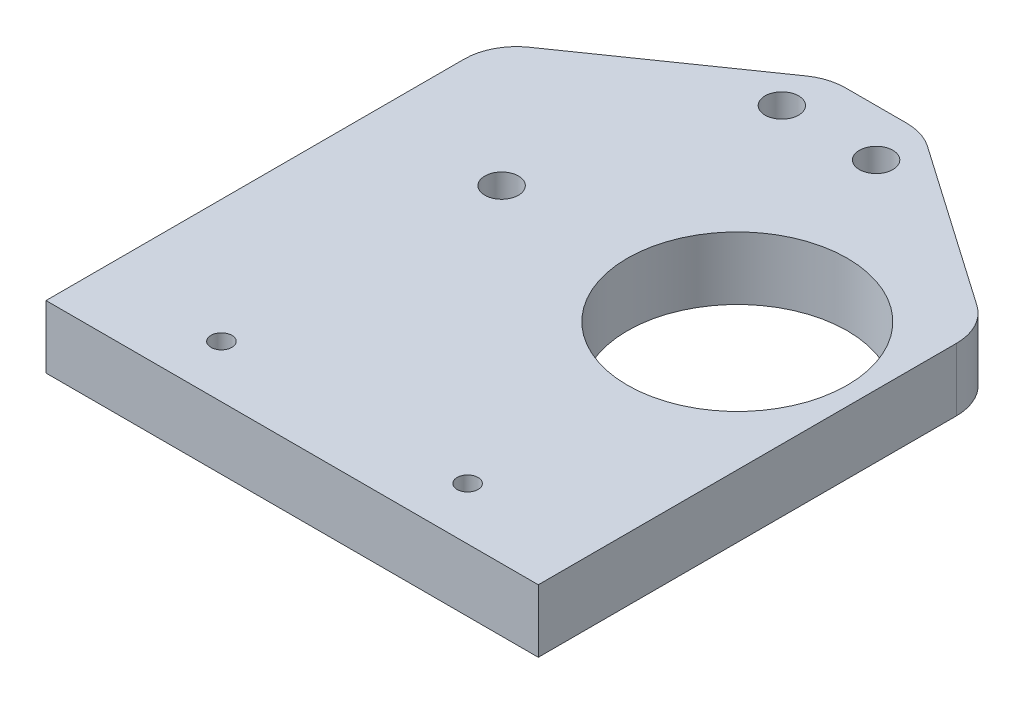
ISO-10303-21;
HEADER;
FILE_DESCRIPTION(('STEP AP214'),'2;1');
FILE_NAME('part.step','',(''),(''),'','','');
FILE_SCHEMA(('AUTOMOTIVE_DESIGN { 1 0 10303 214 1 1 1 1 }'));
ENDSEC;
DATA;
#1=APPLICATION_CONTEXT('core data for automotive mechanical design processes');
#2=APPLICATION_PROTOCOL_DEFINITION('international standard','automotive_design',2000,#1);
#3=PRODUCT_CONTEXT('',#1,'mechanical');
#4=PRODUCT('Part','Part','',(#3));
#5=PRODUCT_RELATED_PRODUCT_CATEGORY('part','',(#4));
#6=PRODUCT_DEFINITION_FORMATION('','',#4);
#7=PRODUCT_DEFINITION_CONTEXT('part definition',#1,'design');
#8=PRODUCT_DEFINITION('design','',#6,#7);
#9=PRODUCT_DEFINITION_SHAPE('','',#8);
#10=(LENGTH_UNIT() NAMED_UNIT(*) SI_UNIT(.MILLI.,.METRE.));
#11=(NAMED_UNIT(*) PLANE_ANGLE_UNIT() SI_UNIT($,.RADIAN.));
#12=(NAMED_UNIT(*) SI_UNIT($,.STERADIAN.) SOLID_ANGLE_UNIT());
#13=UNCERTAINTY_MEASURE_WITH_UNIT(LENGTH_MEASURE(1.E-05),#10,'distance_accuracy_value','');
#14=(GEOMETRIC_REPRESENTATION_CONTEXT(3) GLOBAL_UNCERTAINTY_ASSIGNED_CONTEXT((#13)) GLOBAL_UNIT_ASSIGNED_CONTEXT((#10,
#11,#12)) REPRESENTATION_CONTEXT('',''));
#15=CARTESIAN_POINT('',(0.,0.,0.));
#16=DIRECTION('',(0.,0.,1.));
#17=DIRECTION('',(1.,0.,0.));
#18=AXIS2_PLACEMENT_3D('',#15,#16,#17);
#19=CARTESIAN_POINT('',(0.,6.,0.));
#20=DIRECTION('',(0.,1.,0.));
#21=DIRECTION('',(0.,0.,1.));
#22=AXIS2_PLACEMENT_3D('',#19,#20,#21);
#23=PLANE('',#22);
#24=CARTESIAN_POINT('',(-11.75,6.,5.));
#25=DIRECTION('',(0.,1.,0.));
#26=DIRECTION('',(0.,0.,1.));
#27=AXIS2_PLACEMENT_3D('',#24,#25,#26);
#28=CIRCLE('',#27,1.);
#29=CARTESIAN_POINT('',(-11.75,6.,6.));
#30=VERTEX_POINT('',#29);
#31=EDGE_CURVE('E140',#30,#30,#28,.T.);
#32=ORIENTED_EDGE('',*,*,#31,.F.);
#33=EDGE_LOOP('',(#32));
#34=FACE_BOUND('',#33,.T.);
#35=CARTESIAN_POINT('',(11.75,6.,5.));
#36=DIRECTION('',(0.,1.,0.));
#37=DIRECTION('',(0.,0.,1.));
#38=AXIS2_PLACEMENT_3D('',#35,#36,#37);
#39=CIRCLE('',#38,1.);
#40=CARTESIAN_POINT('',(11.75,6.,6.));
#41=VERTEX_POINT('',#40);
#42=EDGE_CURVE('E143',#41,#41,#39,.T.);
#43=ORIENTED_EDGE('',*,*,#42,.F.);
#44=EDGE_LOOP('',(#43));
#45=FACE_BOUND('',#44,.T.);
#46=CARTESIAN_POINT('',(11.25,6.,-21.25));
#47=DIRECTION('',(0.,-1.,0.));
#48=DIRECTION('',(0.,0.,-1.));
#49=AXIS2_PLACEMENT_3D('',#46,#47,#48);
#50=CIRCLE('',#49,10.5);
#51=CARTESIAN_POINT('',(11.25,6.,-31.75));
#52=VERTEX_POINT('',#51);
#53=EDGE_CURVE('E149',#52,#52,#50,.T.);
#54=ORIENTED_EDGE('',*,*,#53,.T.);
#55=EDGE_LOOP('',(#54));
#56=FACE_BOUND('',#55,.T.);
#57=DIRECTION('',(0.,0.,-1.));
#58=VECTOR('',#57,1.);
#59=CARTESIAN_POINT('',(23.5,6.,-45.75));
#60=LINE('',#59,#58);
#61=CARTESIAN_POINT('',(23.5,6.,10.));
#62=VERTEX_POINT('',#61);
#63=CARTESIAN_POINT('',(23.5,6.,-29.917718035007));
#64=VERTEX_POINT('',#63);
#65=EDGE_CURVE('E182',#62,#64,#60,.T.);
#66=ORIENTED_EDGE('',*,*,#65,.T.);
#67=CARTESIAN_POINT('',(18.5,6.,-29.917718035007));
#68=DIRECTION('',(0.,1.,0.));
#69=DIRECTION('',(0.,0.,1.));
#70=AXIS2_PLACEMENT_3D('',#67,#68,#69);
#71=CIRCLE('',#70,5.);
#72=CARTESIAN_POINT('',(21.3557021727428,6.,-34.0219798566494));
#73=VERTEX_POINT('',#72);
#74=EDGE_CURVE('E201',#64,#73,#71,.T.);
#75=ORIENTED_EDGE('',*,*,#74,.T.);
#76=DIRECTION('',(0.820852364328494,0.,0.571140434548563));
#77=VECTOR('',#76,1.);
#78=CARTESIAN_POINT('',(23.5,6.,-32.53));
#79=LINE('',#78,#77);
#80=CARTESIAN_POINT('',(5.78736954529447,6.,-44.8542618216425));
#81=VERTEX_POINT('',#80);
#82=EDGE_CURVE('E158',#81,#73,#79,.T.);
#83=ORIENTED_EDGE('',*,*,#82,.F.);
#84=CARTESIAN_POINT('',(2.93166737255165,6.,-40.75));
#85=DIRECTION('',(0.,1.,0.));
#86=DIRECTION('',(0.,0.,1.));
#87=AXIS2_PLACEMENT_3D('',#84,#85,#86);
#88=CIRCLE('',#87,5.);
#89=CARTESIAN_POINT('',(2.93166737255165,6.,-45.75));
#90=VERTEX_POINT('',#89);
#91=EDGE_CURVE('E199',#81,#90,#88,.T.);
#92=ORIENTED_EDGE('',*,*,#91,.T.);
#93=DIRECTION('',(-1.,0.,0.));
#94=VECTOR('',#93,1.);
#95=CARTESIAN_POINT('',(23.5,6.,-45.75));
#96=LINE('',#95,#94);
#97=CARTESIAN_POINT('',(-2.93166737255164,6.,-45.75));
#98=VERTEX_POINT('',#97);
#99=EDGE_CURVE('E186',#90,#98,#96,.T.);
#100=ORIENTED_EDGE('',*,*,#99,.T.);
#101=CARTESIAN_POINT('',(-2.93166737255164,6.,-40.75));
#102=DIRECTION('',(0.,1.,0.));
#103=DIRECTION('',(0.,0.,1.));
#104=AXIS2_PLACEMENT_3D('',#101,#102,#103);
#105=CIRCLE('',#104,5.);
#106=CARTESIAN_POINT('',(-5.78736954529445,6.,-44.8542618216425));
#107=VERTEX_POINT('',#106);
#108=EDGE_CURVE('E197',#98,#107,#105,.T.);
#109=ORIENTED_EDGE('',*,*,#108,.T.);
#110=DIRECTION('',(0.820852364328495,0.,-0.571140434548562));
#111=VECTOR('',#110,1.);
#112=CARTESIAN_POINT('',(-23.5,6.,-32.53));
#113=LINE('',#112,#111);
#114=CARTESIAN_POINT('',(-21.3557021727428,6.,-34.0219798566495));
#115=VERTEX_POINT('',#114);
#116=EDGE_CURVE('E152',#115,#107,#113,.T.);
#117=ORIENTED_EDGE('',*,*,#116,.F.);
#118=CARTESIAN_POINT('',(-18.5,6.,-29.917718035007));
#119=DIRECTION('',(0.,1.,0.));
#120=DIRECTION('',(0.,0.,1.));
#121=AXIS2_PLACEMENT_3D('',#118,#119,#120);
#122=CIRCLE('',#121,5.);
#123=CARTESIAN_POINT('',(-23.5,6.,-29.917718035007));
#124=VERTEX_POINT('',#123);
#125=EDGE_CURVE('E195',#115,#124,#122,.T.);
#126=ORIENTED_EDGE('',*,*,#125,.T.);
#127=DIRECTION('',(0.,0.,1.));
#128=VECTOR('',#127,1.);
#129=CARTESIAN_POINT('',(-23.5,6.,-45.75));
#130=LINE('',#129,#128);
#131=CARTESIAN_POINT('',(-23.5,6.,10.));
#132=VERTEX_POINT('',#131);
#133=EDGE_CURVE('E180',#124,#132,#130,.T.);
#134=ORIENTED_EDGE('',*,*,#133,.T.);
#135=DIRECTION('',(-1.,0.,0.));
#136=VECTOR('',#135,1.);
#137=CARTESIAN_POINT('',(-23.5,6.,10.));
#138=LINE('',#137,#136);
#139=EDGE_CURVE('E136',#62,#132,#138,.T.);
#140=ORIENTED_EDGE('',*,*,#139,.F.);
#141=EDGE_LOOP('',(#66,#75,#83,#92,#100,#109,#117,#126,#134,#140));
#142=FACE_BOUND('',#141,.T.);
#143=CARTESIAN_POINT('',(-4.5,6.,-41.25));
#144=DIRECTION('',(0.,1.,0.));
#145=DIRECTION('',(0.,0.,1.));
#146=AXIS2_PLACEMENT_3D('',#143,#144,#145);
#147=CIRCLE('',#146,1.6);
#148=CARTESIAN_POINT('',(-4.5,6.,-39.65));
#149=VERTEX_POINT('',#148);
#150=EDGE_CURVE('E120',#149,#149,#147,.T.);
#151=ORIENTED_EDGE('',*,*,#150,.F.);
#152=EDGE_LOOP('',(#151));
#153=FACE_BOUND('',#152,.T.);
#154=CARTESIAN_POINT('',(-11.25,6.,-21.25));
#155=DIRECTION('',(0.,1.,0.));
#156=DIRECTION('',(0.,0.,1.));
#157=AXIS2_PLACEMENT_3D('',#154,#155,#156);
#158=CIRCLE('',#157,1.6);
#159=CARTESIAN_POINT('',(-11.25,6.,-19.65));
#160=VERTEX_POINT('',#159);
#161=EDGE_CURVE('E170',#160,#160,#158,.T.);
#162=ORIENTED_EDGE('',*,*,#161,.F.);
#163=EDGE_LOOP('',(#162));
#164=FACE_BOUND('',#163,.T.);
#165=CARTESIAN_POINT('',(4.5,6.,-41.25));
#166=DIRECTION('',(0.,1.,0.));
#167=DIRECTION('',(0.,0.,-1.));
#168=AXIS2_PLACEMENT_3D('',#165,#166,#167);
#169=CIRCLE('',#168,1.6);
#170=CARTESIAN_POINT('',(4.5,6.,-42.85));
#171=VERTEX_POINT('',#170);
#172=EDGE_CURVE('E164',#171,#171,#169,.T.);
#173=ORIENTED_EDGE('',*,*,#172,.F.);
#174=EDGE_LOOP('',(#173));
#175=FACE_BOUND('',#174,.T.);
#176=ADVANCED_FACE('F36',(#34,#45,#56,#142,#153,#164,#175),#23,.T.);
#177=CARTESIAN_POINT('',(0.,0.,0.));
#178=DIRECTION('',(0.,1.,0.));
#179=DIRECTION('',(0.,0.,1.));
#180=AXIS2_PLACEMENT_3D('',#177,#178,#179);
#181=PLANE('',#180);
#182=CARTESIAN_POINT('',(-11.75,0.,5.));
#183=DIRECTION('',(0.,1.,0.));
#184=DIRECTION('',(0.,0.,1.));
#185=AXIS2_PLACEMENT_3D('',#182,#183,#184);
#186=CIRCLE('',#185,1.);
#187=CARTESIAN_POINT('',(-11.75,0.,6.));
#188=VERTEX_POINT('',#187);
#189=EDGE_CURVE('E137',#188,#188,#186,.T.);
#190=ORIENTED_EDGE('',*,*,#189,.T.);
#191=EDGE_LOOP('',(#190));
#192=FACE_BOUND('',#191,.T.);
#193=CARTESIAN_POINT('',(11.75,0.,5.));
#194=DIRECTION('',(0.,1.,0.));
#195=DIRECTION('',(0.,0.,1.));
#196=AXIS2_PLACEMENT_3D('',#193,#194,#195);
#197=CIRCLE('',#196,1.);
#198=CARTESIAN_POINT('',(11.75,0.,6.));
#199=VERTEX_POINT('',#198);
#200=EDGE_CURVE('E438',#199,#199,#197,.T.);
#201=ORIENTED_EDGE('',*,*,#200,.T.);
#202=EDGE_LOOP('',(#201));
#203=FACE_BOUND('',#202,.T.);
#204=CARTESIAN_POINT('',(11.25,0.,-21.25));
#205=DIRECTION('',(0.,-1.,0.));
#206=DIRECTION('',(0.,0.,-1.));
#207=AXIS2_PLACEMENT_3D('',#204,#205,#206);
#208=CIRCLE('',#207,10.5);
#209=CARTESIAN_POINT('',(11.25,0.,-31.75));
#210=VERTEX_POINT('',#209);
#211=EDGE_CURVE('E148',#210,#210,#208,.T.);
#212=ORIENTED_EDGE('',*,*,#211,.F.);
#213=EDGE_LOOP('',(#212));
#214=FACE_BOUND('',#213,.T.);
#215=DIRECTION('',(0.820852364328494,0.,0.571140434548563));
#216=VECTOR('',#215,1.);
#217=CARTESIAN_POINT('',(23.5,0.,-32.53));
#218=LINE('',#217,#216);
#219=CARTESIAN_POINT('',(5.78736954529447,0.,-44.8542618216425));
#220=VERTEX_POINT('',#219);
#221=CARTESIAN_POINT('',(21.3557021727428,0.,-34.0219798566494));
#222=VERTEX_POINT('',#221);
#223=EDGE_CURVE('E155',#220,#222,#218,.T.);
#224=ORIENTED_EDGE('',*,*,#223,.T.);
#225=CARTESIAN_POINT('',(18.5,0.,-29.917718035007));
#226=DIRECTION('',(0.,1.,0.));
#227=DIRECTION('',(0.,0.,1.));
#228=AXIS2_PLACEMENT_3D('',#225,#226,#227);
#229=CIRCLE('',#228,5.);
#230=CARTESIAN_POINT('',(23.5,0.,-29.917718035007));
#231=VERTEX_POINT('',#230);
#232=EDGE_CURVE('E213',#222,#231,#229,.F.);
#233=ORIENTED_EDGE('',*,*,#232,.T.);
#234=DIRECTION('',(0.,0.,-1.));
#235=VECTOR('',#234,1.);
#236=CARTESIAN_POINT('',(23.5,0.,-45.75));
#237=LINE('',#236,#235);
#238=CARTESIAN_POINT('',(23.5,0.,10.));
#239=VERTEX_POINT('',#238);
#240=EDGE_CURVE('E119',#239,#231,#237,.T.);
#241=ORIENTED_EDGE('',*,*,#240,.F.);
#242=DIRECTION('',(1.,0.,0.));
#243=VECTOR('',#242,1.);
#244=CARTESIAN_POINT('',(-23.5,0.,10.));
#245=LINE('',#244,#243);
#246=CARTESIAN_POINT('',(-23.5,0.,10.));
#247=VERTEX_POINT('',#246);
#248=EDGE_CURVE('E123',#247,#239,#245,.T.);
#249=ORIENTED_EDGE('',*,*,#248,.F.);
#250=DIRECTION('',(0.,0.,1.));
#251=VECTOR('',#250,1.);
#252=CARTESIAN_POINT('',(-23.5,0.,-45.75));
#253=LINE('',#252,#251);
#254=CARTESIAN_POINT('',(-23.5,0.,-29.917718035007));
#255=VERTEX_POINT('',#254);
#256=EDGE_CURVE('E112',#255,#247,#253,.T.);
#257=ORIENTED_EDGE('',*,*,#256,.F.);
#258=CARTESIAN_POINT('',(-18.5,0.,-29.917718035007));
#259=DIRECTION('',(0.,1.,0.));
#260=DIRECTION('',(0.,0.,1.));
#261=AXIS2_PLACEMENT_3D('',#258,#259,#260);
#262=CIRCLE('',#261,5.);
#263=CARTESIAN_POINT('',(-21.3557021727428,0.,-34.0219798566495));
#264=VERTEX_POINT('',#263);
#265=EDGE_CURVE('E57',#255,#264,#262,.F.);
#266=ORIENTED_EDGE('',*,*,#265,.T.);
#267=DIRECTION('',(0.820852364328495,0.,-0.571140434548562));
#268=VECTOR('',#267,1.);
#269=CARTESIAN_POINT('',(-23.5,0.,-32.53));
#270=LINE('',#269,#268);
#271=CARTESIAN_POINT('',(-5.78736954529445,0.,-44.8542618216425));
#272=VERTEX_POINT('',#271);
#273=EDGE_CURVE('E161',#264,#272,#270,.T.);
#274=ORIENTED_EDGE('',*,*,#273,.T.);
#275=CARTESIAN_POINT('',(-2.93166737255164,0.,-40.75));
#276=DIRECTION('',(0.,1.,0.));
#277=DIRECTION('',(0.,0.,1.));
#278=AXIS2_PLACEMENT_3D('',#275,#276,#277);
#279=CIRCLE('',#278,5.);
#280=CARTESIAN_POINT('',(-2.93166737255164,0.,-45.75));
#281=VERTEX_POINT('',#280);
#282=EDGE_CURVE('E209',#272,#281,#279,.F.);
#283=ORIENTED_EDGE('',*,*,#282,.T.);
#284=DIRECTION('',(-1.,0.,0.));
#285=VECTOR('',#284,1.);
#286=CARTESIAN_POINT('',(23.5,0.,-45.75));
#287=LINE('',#286,#285);
#288=CARTESIAN_POINT('',(2.93166737255165,0.,-45.75));
#289=VERTEX_POINT('',#288);
#290=EDGE_CURVE('E183',#289,#281,#287,.T.);
#291=ORIENTED_EDGE('',*,*,#290,.F.);
#292=CARTESIAN_POINT('',(2.93166737255165,0.,-40.75));
#293=DIRECTION('',(0.,1.,0.));
#294=DIRECTION('',(0.,0.,1.));
#295=AXIS2_PLACEMENT_3D('',#292,#293,#294);
#296=CIRCLE('',#295,5.);
#297=EDGE_CURVE('E211',#289,#220,#296,.F.);
#298=ORIENTED_EDGE('',*,*,#297,.T.);
#299=EDGE_LOOP('',(#224,#233,#241,#249,#257,#266,#274,#283,#291,#298));
#300=FACE_BOUND('',#299,.T.);
#301=CARTESIAN_POINT('',(-4.5,0.,-41.25));
#302=DIRECTION('',(0.,1.,0.));
#303=DIRECTION('',(0.,0.,1.));
#304=AXIS2_PLACEMENT_3D('',#301,#302,#303);
#305=CIRCLE('',#304,1.6);
#306=CARTESIAN_POINT('',(-4.5,0.,-39.65));
#307=VERTEX_POINT('',#306);
#308=EDGE_CURVE('E173',#307,#307,#305,.T.);
#309=ORIENTED_EDGE('',*,*,#308,.T.);
#310=EDGE_LOOP('',(#309));
#311=FACE_BOUND('',#310,.T.);
#312=CARTESIAN_POINT('',(-11.25,0.,-21.25));
#313=DIRECTION('',(0.,1.,0.));
#314=DIRECTION('',(0.,0.,1.));
#315=AXIS2_PLACEMENT_3D('',#312,#313,#314);
#316=CIRCLE('',#315,1.6);
#317=CARTESIAN_POINT('',(-11.25,0.,-19.65));
#318=VERTEX_POINT('',#317);
#319=EDGE_CURVE('E167',#318,#318,#316,.T.);
#320=ORIENTED_EDGE('',*,*,#319,.T.);
#321=EDGE_LOOP('',(#320));
#322=FACE_BOUND('',#321,.T.);
#323=CARTESIAN_POINT('',(4.5,0.,-41.25));
#324=DIRECTION('',(0.,1.,0.));
#325=DIRECTION('',(0.,0.,-1.));
#326=AXIS2_PLACEMENT_3D('',#323,#324,#325);
#327=CIRCLE('',#326,1.6);
#328=CARTESIAN_POINT('',(4.5,0.,-42.85));
#329=VERTEX_POINT('',#328);
#330=EDGE_CURVE('E157',#329,#329,#327,.T.);
#331=ORIENTED_EDGE('',*,*,#330,.T.);
#332=EDGE_LOOP('',(#331));
#333=FACE_BOUND('',#332,.T.);
#334=ADVANCED_FACE('F125',(#192,#203,#214,#300,#311,#322,#333),#181,.F.);
#335=CARTESIAN_POINT('',(-23.5,6.,-45.75));
#336=DIRECTION('',(1.,0.,0.));
#337=DIRECTION('',(0.,0.,-1.));
#338=AXIS2_PLACEMENT_3D('',#335,#336,#337);
#339=PLANE('',#338);
#340=ORIENTED_EDGE('',*,*,#133,.F.);
#341=DIRECTION('',(0.,1.,0.));
#342=VECTOR('',#341,1.);
#343=CARTESIAN_POINT('',(-23.5,6.,-29.917718035007));
#344=LINE('',#343,#342);
#345=EDGE_CURVE('E11',#124,#255,#344,.F.);
#346=ORIENTED_EDGE('',*,*,#345,.T.);
#347=ORIENTED_EDGE('',*,*,#256,.T.);
#348=DIRECTION('',(0.,-1.,0.));
#349=VECTOR('',#348,1.);
#350=CARTESIAN_POINT('',(-23.5,6.,10.));
#351=LINE('',#350,#349);
#352=EDGE_CURVE('E117',#132,#247,#351,.T.);
#353=ORIENTED_EDGE('',*,*,#352,.F.);
#354=EDGE_LOOP('',(#340,#346,#347,#353));
#355=FACE_BOUND('',#354,.T.);
#356=ADVANCED_FACE('F115',(#355),#339,.F.);
#357=CARTESIAN_POINT('',(23.5,6.,-45.75));
#358=DIRECTION('',(-1.,0.,0.));
#359=DIRECTION('',(0.,0.,1.));
#360=AXIS2_PLACEMENT_3D('',#357,#358,#359);
#361=PLANE('',#360);
#362=ORIENTED_EDGE('',*,*,#240,.T.);
#363=DIRECTION('',(0.,1.,0.));
#364=VECTOR('',#363,1.);
#365=CARTESIAN_POINT('',(23.5,6.,-29.917718035007));
#366=LINE('',#365,#364);
#367=EDGE_CURVE('E188',#231,#64,#366,.T.);
#368=ORIENTED_EDGE('',*,*,#367,.T.);
#369=ORIENTED_EDGE('',*,*,#65,.F.);
#370=DIRECTION('',(0.,1.,0.));
#371=VECTOR('',#370,1.);
#372=CARTESIAN_POINT('',(23.5,6.,10.));
#373=LINE('',#372,#371);
#374=EDGE_CURVE('E131',#239,#62,#373,.T.);
#375=ORIENTED_EDGE('',*,*,#374,.F.);
#376=EDGE_LOOP('',(#362,#368,#369,#375));
#377=FACE_BOUND('',#376,.T.);
#378=ADVANCED_FACE('F251',(#377),#361,.F.);
#379=CARTESIAN_POINT('',(23.5,6.,-45.75));
#380=DIRECTION('',(0.,0.,1.));
#381=DIRECTION('',(1.,0.,0.));
#382=AXIS2_PLACEMENT_3D('',#379,#380,#381);
#383=PLANE('',#382);
#384=ORIENTED_EDGE('',*,*,#99,.F.);
#385=DIRECTION('',(0.,1.,0.));
#386=VECTOR('',#385,1.);
#387=CARTESIAN_POINT('',(2.93166737255165,6.,-45.75));
#388=LINE('',#387,#386);
#389=EDGE_CURVE('E218',#90,#289,#388,.F.);
#390=ORIENTED_EDGE('',*,*,#389,.T.);
#391=ORIENTED_EDGE('',*,*,#290,.T.);
#392=DIRECTION('',(0.,1.,0.));
#393=VECTOR('',#392,1.);
#394=CARTESIAN_POINT('',(-2.93166737255164,6.,-45.75));
#395=LINE('',#394,#393);
#396=EDGE_CURVE('E215',#281,#98,#395,.T.);
#397=ORIENTED_EDGE('',*,*,#396,.T.);
#398=EDGE_LOOP('',(#384,#390,#391,#397));
#399=FACE_BOUND('',#398,.T.);
#400=ADVANCED_FACE('F234',(#399),#383,.F.);
#401=CARTESIAN_POINT('',(-4.5,6.,-41.25));
#402=DIRECTION('',(0.,-1.,0.));
#403=DIRECTION('',(0.,0.,-1.));
#404=AXIS2_PLACEMENT_3D('',#401,#402,#403);
#405=CYLINDRICAL_SURFACE('',#404,1.6);
#406=ORIENTED_EDGE('',*,*,#150,.T.);
#407=EDGE_LOOP('',(#406));
#408=FACE_BOUND('',#407,.T.);
#409=ORIENTED_EDGE('',*,*,#308,.F.);
#410=EDGE_LOOP('',(#409));
#411=FACE_BOUND('',#410,.T.);
#412=ADVANCED_FACE('F271',(#408,#411),#405,.F.);
#413=CARTESIAN_POINT('',(-11.25,6.,-21.25));
#414=DIRECTION('',(0.,-1.,0.));
#415=DIRECTION('',(0.,0.,-1.));
#416=AXIS2_PLACEMENT_3D('',#413,#414,#415);
#417=CYLINDRICAL_SURFACE('',#416,1.6);
#418=ORIENTED_EDGE('',*,*,#161,.T.);
#419=EDGE_LOOP('',(#418));
#420=FACE_BOUND('',#419,.T.);
#421=ORIENTED_EDGE('',*,*,#319,.F.);
#422=EDGE_LOOP('',(#421));
#423=FACE_BOUND('',#422,.T.);
#424=ADVANCED_FACE('F368',(#420,#423),#417,.F.);
#425=CARTESIAN_POINT('',(4.5,6.,-41.25));
#426=DIRECTION('',(0.,-1.,0.));
#427=DIRECTION('',(0.,0.,-1.));
#428=AXIS2_PLACEMENT_3D('',#425,#426,#427);
#429=CYLINDRICAL_SURFACE('',#428,1.6);
#430=ORIENTED_EDGE('',*,*,#172,.T.);
#431=EDGE_LOOP('',(#430));
#432=FACE_BOUND('',#431,.T.);
#433=ORIENTED_EDGE('',*,*,#330,.F.);
#434=EDGE_LOOP('',(#433));
#435=FACE_BOUND('',#434,.T.);
#436=ADVANCED_FACE('F366',(#432,#435),#429,.F.);
#437=CARTESIAN_POINT('',(-23.5,0.,-32.53));
#438=DIRECTION('',(0.571140434548562,0.,0.820852364328495));
#439=DIRECTION('',(0.820852364328495,0.,-0.571140434548562));
#440=AXIS2_PLACEMENT_3D('',#437,#438,#439);
#441=PLANE('',#440);
#442=ORIENTED_EDGE('',*,*,#116,.T.);
#443=DIRECTION('',(0.,1.,0.));
#444=VECTOR('',#443,1.);
#445=CARTESIAN_POINT('',(-5.78736954529445,0.,-44.8542618216425));
#446=LINE('',#445,#444);
#447=EDGE_CURVE('E44',#107,#272,#446,.F.);
#448=ORIENTED_EDGE('',*,*,#447,.T.);
#449=ORIENTED_EDGE('',*,*,#273,.F.);
#450=DIRECTION('',(0.,1.,0.));
#451=VECTOR('',#450,1.);
#452=CARTESIAN_POINT('',(-21.3557021727428,0.,-34.0219798566495));
#453=LINE('',#452,#451);
#454=EDGE_CURVE('E220',#264,#115,#453,.T.);
#455=ORIENTED_EDGE('',*,*,#454,.T.);
#456=EDGE_LOOP('',(#442,#448,#449,#455));
#457=FACE_BOUND('',#456,.T.);
#458=ADVANCED_FACE('F224',(#457),#441,.F.);
#459=CARTESIAN_POINT('',(23.5,0.,-32.53));
#460=DIRECTION('',(-0.571140434548563,0.,0.820852364328494));
#461=DIRECTION('',(0.820852364328494,0.,0.571140434548563));
#462=AXIS2_PLACEMENT_3D('',#459,#460,#461);
#463=PLANE('',#462);
#464=ORIENTED_EDGE('',*,*,#82,.T.);
#465=DIRECTION('',(0.,1.,0.));
#466=VECTOR('',#465,1.);
#467=CARTESIAN_POINT('',(21.3557021727428,0.,-34.0219798566494));
#468=LINE('',#467,#466);
#469=EDGE_CURVE('E206',#73,#222,#468,.F.);
#470=ORIENTED_EDGE('',*,*,#469,.T.);
#471=ORIENTED_EDGE('',*,*,#223,.F.);
#472=DIRECTION('',(0.,1.,0.));
#473=VECTOR('',#472,1.);
#474=CARTESIAN_POINT('',(5.78736954529446,0.,-44.8542618216425));
#475=LINE('',#474,#473);
#476=EDGE_CURVE('E203',#220,#81,#475,.T.);
#477=ORIENTED_EDGE('',*,*,#476,.T.);
#478=EDGE_LOOP('',(#464,#470,#471,#477));
#479=FACE_BOUND('',#478,.T.);
#480=ADVANCED_FACE('F244',(#479),#463,.F.);
#481=CARTESIAN_POINT('',(18.5,6.,-29.917718035007));
#482=DIRECTION('',(0.,1.,0.));
#483=DIRECTION('',(0.,0.,1.));
#484=AXIS2_PLACEMENT_3D('',#481,#482,#483);
#485=CYLINDRICAL_SURFACE('',#484,5.);
#486=ORIENTED_EDGE('',*,*,#232,.F.);
#487=ORIENTED_EDGE('',*,*,#469,.F.);
#488=ORIENTED_EDGE('',*,*,#74,.F.);
#489=ORIENTED_EDGE('',*,*,#367,.F.);
#490=EDGE_LOOP('',(#486,#487,#488,#489));
#491=FACE_BOUND('',#490,.T.);
#492=ADVANCED_FACE('F249',(#491),#485,.T.);
#493=CARTESIAN_POINT('',(2.93166737255165,0.,-40.75));
#494=DIRECTION('',(0.,1.,0.));
#495=DIRECTION('',(0.,0.,1.));
#496=AXIS2_PLACEMENT_3D('',#493,#494,#495);
#497=CYLINDRICAL_SURFACE('',#496,5.);
#498=ORIENTED_EDGE('',*,*,#297,.F.);
#499=ORIENTED_EDGE('',*,*,#389,.F.);
#500=ORIENTED_EDGE('',*,*,#91,.F.);
#501=ORIENTED_EDGE('',*,*,#476,.F.);
#502=EDGE_LOOP('',(#498,#499,#500,#501));
#503=FACE_BOUND('',#502,.T.);
#504=ADVANCED_FACE('F241',(#503),#497,.T.);
#505=CARTESIAN_POINT('',(-2.93166737255164,6.,-40.75));
#506=DIRECTION('',(0.,1.,0.));
#507=DIRECTION('',(0.,0.,1.));
#508=AXIS2_PLACEMENT_3D('',#505,#506,#507);
#509=CYLINDRICAL_SURFACE('',#508,5.);
#510=ORIENTED_EDGE('',*,*,#282,.F.);
#511=ORIENTED_EDGE('',*,*,#447,.F.);
#512=ORIENTED_EDGE('',*,*,#108,.F.);
#513=ORIENTED_EDGE('',*,*,#396,.F.);
#514=EDGE_LOOP('',(#510,#511,#512,#513));
#515=FACE_BOUND('',#514,.T.);
#516=ADVANCED_FACE('F232',(#515),#509,.T.);
#517=CARTESIAN_POINT('',(-18.5,0.,-29.917718035007));
#518=DIRECTION('',(0.,1.,0.));
#519=DIRECTION('',(0.,0.,1.));
#520=AXIS2_PLACEMENT_3D('',#517,#518,#519);
#521=CYLINDRICAL_SURFACE('',#520,5.);
#522=ORIENTED_EDGE('',*,*,#265,.F.);
#523=ORIENTED_EDGE('',*,*,#345,.F.);
#524=ORIENTED_EDGE('',*,*,#125,.F.);
#525=ORIENTED_EDGE('',*,*,#454,.F.);
#526=EDGE_LOOP('',(#522,#523,#524,#525));
#527=FACE_BOUND('',#526,.T.);
#528=ADVANCED_FACE('F38',(#527),#521,.T.);
#529=CARTESIAN_POINT('',(11.25,6.,-21.25));
#530=DIRECTION('',(0.,-1.,0.));
#531=DIRECTION('',(0.,0.,-1.));
#532=AXIS2_PLACEMENT_3D('',#529,#530,#531);
#533=CYLINDRICAL_SURFACE('',#532,10.5);
#534=ORIENTED_EDGE('',*,*,#53,.F.);
#535=EDGE_LOOP('',(#534));
#536=FACE_BOUND('',#535,.T.);
#537=ORIENTED_EDGE('',*,*,#211,.T.);
#538=EDGE_LOOP('',(#537));
#539=FACE_BOUND('',#538,.T.);
#540=ADVANCED_FACE('F253',(#536,#539),#533,.F.);
#541=CARTESIAN_POINT('',(0.,0.,10.));
#542=DIRECTION('',(0.,0.,1.));
#543=DIRECTION('',(1.,0.,0.));
#544=AXIS2_PLACEMENT_3D('',#541,#542,#543);
#545=PLANE('',#544);
#546=ORIENTED_EDGE('',*,*,#352,.T.);
#547=ORIENTED_EDGE('',*,*,#248,.T.);
#548=ORIENTED_EDGE('',*,*,#374,.T.);
#549=ORIENTED_EDGE('',*,*,#139,.T.);
#550=EDGE_LOOP('',(#546,#547,#548,#549));
#551=FACE_BOUND('',#550,.T.);
#552=ADVANCED_FACE('F134',(#551),#545,.T.);
#553=CARTESIAN_POINT('',(11.75,0.,5.));
#554=DIRECTION('',(0.,1.,0.));
#555=DIRECTION('',(0.,0.,1.));
#556=AXIS2_PLACEMENT_3D('',#553,#554,#555);
#557=CYLINDRICAL_SURFACE('',#556,1.);
#558=ORIENTED_EDGE('',*,*,#200,.F.);
#559=EDGE_LOOP('',(#558));
#560=FACE_BOUND('',#559,.T.);
#561=ORIENTED_EDGE('',*,*,#42,.T.);
#562=EDGE_LOOP('',(#561));
#563=FACE_BOUND('',#562,.T.);
#564=ADVANCED_FACE('F326',(#560,#563),#557,.F.);
#565=CARTESIAN_POINT('',(-11.75,0.,5.));
#566=DIRECTION('',(0.,1.,0.));
#567=DIRECTION('',(0.,0.,1.));
#568=AXIS2_PLACEMENT_3D('',#565,#566,#567);
#569=CYLINDRICAL_SURFACE('',#568,1.);
#570=ORIENTED_EDGE('',*,*,#189,.F.);
#571=EDGE_LOOP('',(#570));
#572=FACE_BOUND('',#571,.T.);
#573=ORIENTED_EDGE('',*,*,#31,.T.);
#574=EDGE_LOOP('',(#573));
#575=FACE_BOUND('',#574,.T.);
#576=ADVANCED_FACE('F346',(#572,#575),#569,.F.);
#577=CLOSED_SHELL('',(#176,#334,#356,#378,#400,#412,#424,#436,#458,#480,#492,#504,#516,#528,
#540,#552,#564,#576));
#578=MANIFOLD_SOLID_BREP('B2',#577);
#579=ADVANCED_BREP_SHAPE_REPRESENTATION('',(#18,#578),#14);
#580=SHAPE_DEFINITION_REPRESENTATION(#9,#579);
ENDSEC;
END-ISO-10303-21;
